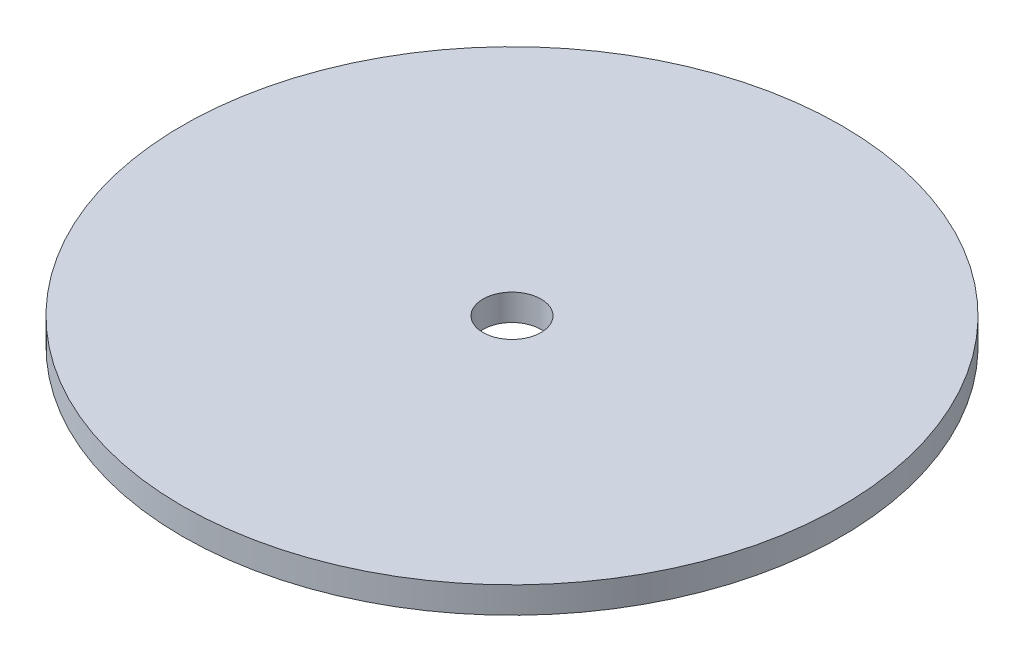
ISO-10303-21;
HEADER;
FILE_DESCRIPTION(('STEP AP214'),'2;1');
FILE_NAME('part.step','',(''),(''),'','','');
FILE_SCHEMA(('AUTOMOTIVE_DESIGN { 1 0 10303 214 1 1 1 1 }'));
ENDSEC;
DATA;
#1=APPLICATION_CONTEXT('core data for automotive mechanical design processes');
#2=APPLICATION_PROTOCOL_DEFINITION('international standard','automotive_design',2000,#1);
#3=PRODUCT_CONTEXT('',#1,'mechanical');
#4=PRODUCT('Part','Part','',(#3));
#5=PRODUCT_RELATED_PRODUCT_CATEGORY('part','',(#4));
#6=PRODUCT_DEFINITION_FORMATION('','',#4);
#7=PRODUCT_DEFINITION_CONTEXT('part definition',#1,'design');
#8=PRODUCT_DEFINITION('design','',#6,#7);
#9=PRODUCT_DEFINITION_SHAPE('','',#8);
#10=(LENGTH_UNIT() NAMED_UNIT(*) SI_UNIT(.MILLI.,.METRE.));
#11=(NAMED_UNIT(*) PLANE_ANGLE_UNIT() SI_UNIT($,.RADIAN.));
#12=(NAMED_UNIT(*) SI_UNIT($,.STERADIAN.) SOLID_ANGLE_UNIT());
#13=UNCERTAINTY_MEASURE_WITH_UNIT(LENGTH_MEASURE(1.E-05),#10,'distance_accuracy_value','');
#14=(GEOMETRIC_REPRESENTATION_CONTEXT(3) GLOBAL_UNCERTAINTY_ASSIGNED_CONTEXT((#13)) GLOBAL_UNIT_ASSIGNED_CONTEXT((#10,
#11,#12)) REPRESENTATION_CONTEXT('',''));
#15=CARTESIAN_POINT('',(0.,0.,0.));
#16=DIRECTION('',(0.,0.,1.));
#17=DIRECTION('',(1.,0.,0.));
#18=AXIS2_PLACEMENT_3D('',#15,#16,#17);
#19=CARTESIAN_POINT('',(0.,3.,0.));
#20=DIRECTION('',(0.,-1.,0.));
#21=DIRECTION('',(0.,0.,-1.));
#22=AXIS2_PLACEMENT_3D('',#19,#20,#21);
#23=CYLINDRICAL_SURFACE('',#22,37.5);
#24=CARTESIAN_POINT('',(0.,3.,0.));
#25=DIRECTION('',(0.,1.,0.));
#26=DIRECTION('',(0.,0.,1.));
#27=AXIS2_PLACEMENT_3D('',#24,#25,#26);
#28=CIRCLE('',#27,37.5);
#29=CARTESIAN_POINT('',(0.,3.,37.5));
#30=VERTEX_POINT('',#29);
#31=EDGE_CURVE('E10',#30,#30,#28,.T.);
#32=ORIENTED_EDGE('',*,*,#31,.F.);
#33=EDGE_LOOP('',(#32));
#34=FACE_BOUND('',#33,.T.);
#35=CARTESIAN_POINT('',(0.,0.,0.));
#36=DIRECTION('',(0.,1.,0.));
#37=DIRECTION('',(0.,0.,1.));
#38=AXIS2_PLACEMENT_3D('',#35,#36,#37);
#39=CIRCLE('',#38,37.5);
#40=CARTESIAN_POINT('',(0.,0.,37.5));
#41=VERTEX_POINT('',#40);
#42=EDGE_CURVE('E35',#41,#41,#39,.T.);
#43=ORIENTED_EDGE('',*,*,#42,.T.);
#44=EDGE_LOOP('',(#43));
#45=FACE_BOUND('',#44,.T.);
#46=ADVANCED_FACE('F32',(#34,#45),#23,.T.);
#47=CARTESIAN_POINT('',(0.,3.,0.));
#48=DIRECTION('',(0.,1.,0.));
#49=DIRECTION('',(0.,0.,1.));
#50=AXIS2_PLACEMENT_3D('',#47,#48,#49);
#51=PLANE('',#50);
#52=CARTESIAN_POINT('',(0.,3.,0.));
#53=DIRECTION('',(0.,1.,0.));
#54=DIRECTION('',(0.,0.,1.));
#55=AXIS2_PLACEMENT_3D('',#52,#53,#54);
#56=CIRCLE('',#55,3.302);
#57=CARTESIAN_POINT('',(0.,3.,3.302));
#58=VERTEX_POINT('',#57);
#59=EDGE_CURVE('E44',#58,#58,#56,.T.);
#60=ORIENTED_EDGE('',*,*,#59,.F.);
#61=EDGE_LOOP('',(#60));
#62=FACE_BOUND('',#61,.T.);
#63=ORIENTED_EDGE('',*,*,#31,.T.);
#64=EDGE_LOOP('',(#63));
#65=FACE_BOUND('',#64,.T.);
#66=ADVANCED_FACE('F59',(#62,#65),#51,.T.);
#67=CARTESIAN_POINT('',(0.,0.,0.));
#68=DIRECTION('',(0.,1.,0.));
#69=DIRECTION('',(0.,0.,1.));
#70=AXIS2_PLACEMENT_3D('',#67,#68,#69);
#71=PLANE('',#70);
#72=CARTESIAN_POINT('',(0.,0.,0.));
#73=DIRECTION('',(0.,1.,0.));
#74=DIRECTION('',(0.,0.,1.));
#75=AXIS2_PLACEMENT_3D('',#72,#73,#74);
#76=CIRCLE('',#75,3.302);
#77=CARTESIAN_POINT('',(0.,0.,3.302));
#78=VERTEX_POINT('',#77);
#79=EDGE_CURVE('E42',#78,#78,#76,.T.);
#80=ORIENTED_EDGE('',*,*,#79,.T.);
#81=EDGE_LOOP('',(#80));
#82=FACE_BOUND('',#81,.T.);
#83=ORIENTED_EDGE('',*,*,#42,.F.);
#84=EDGE_LOOP('',(#83));
#85=FACE_BOUND('',#84,.T.);
#86=ADVANCED_FACE('F50',(#82,#85),#71,.F.);
#87=CARTESIAN_POINT('',(0.,0.,0.));
#88=DIRECTION('',(0.,1.,0.));
#89=DIRECTION('',(0.,0.,1.));
#90=AXIS2_PLACEMENT_3D('',#87,#88,#89);
#91=CYLINDRICAL_SURFACE('',#90,3.302);
#92=ORIENTED_EDGE('',*,*,#79,.F.);
#93=EDGE_LOOP('',(#92));
#94=FACE_BOUND('',#93,.T.);
#95=ORIENTED_EDGE('',*,*,#59,.T.);
#96=EDGE_LOOP('',(#95));
#97=FACE_BOUND('',#96,.T.);
#98=ADVANCED_FACE('F53',(#94,#97),#91,.F.);
#99=CLOSED_SHELL('',(#46,#66,#86,#98));
#100=MANIFOLD_SOLID_BREP('B2',#99);
#101=ADVANCED_BREP_SHAPE_REPRESENTATION('',(#18,#100),#14);
#102=SHAPE_DEFINITION_REPRESENTATION(#9,#101);
ENDSEC;
END-ISO-10303-21;
